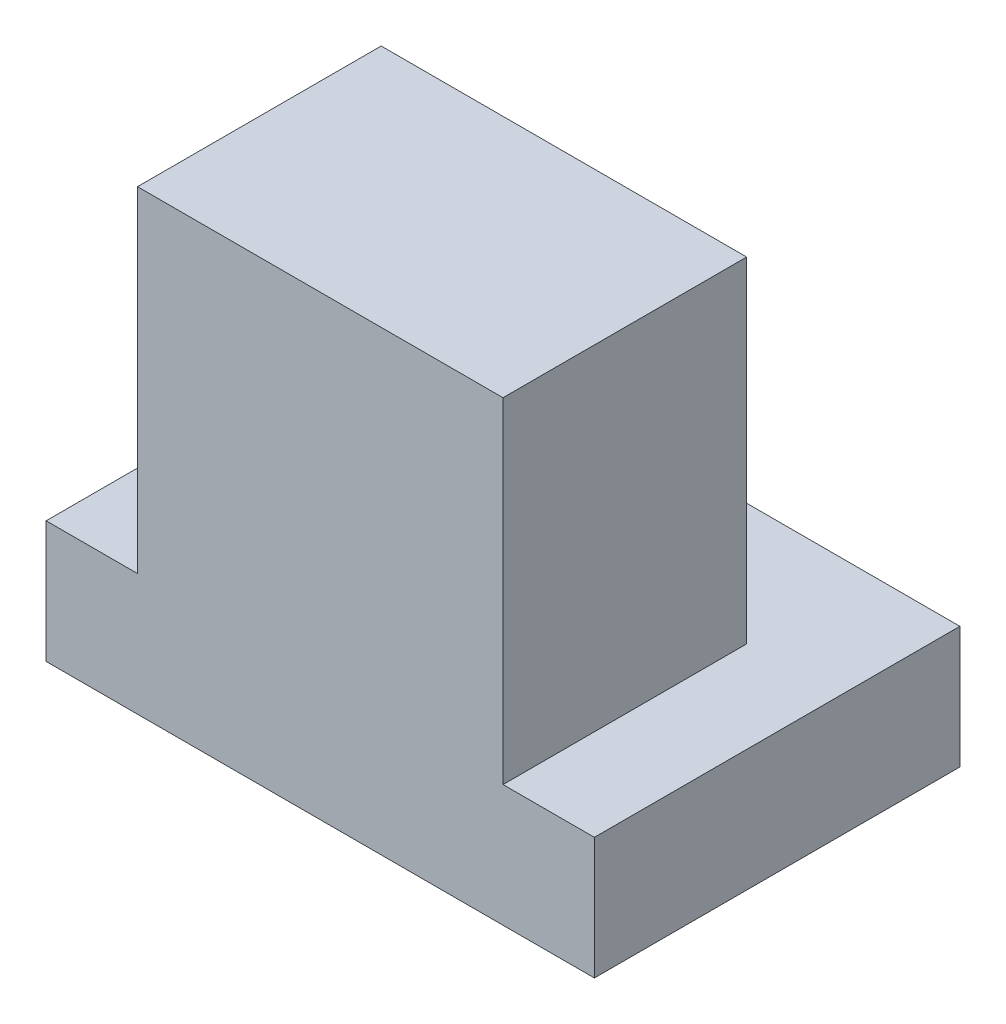
ISO-10303-21;
HEADER;
FILE_DESCRIPTION(('STEP AP214'),'2;1');
FILE_NAME('part.step','',(''),(''),'','','');
FILE_SCHEMA(('AUTOMOTIVE_DESIGN { 1 0 10303 214 1 1 1 1 }'));
ENDSEC;
DATA;
#1=APPLICATION_CONTEXT('core data for automotive mechanical design processes');
#2=APPLICATION_PROTOCOL_DEFINITION('international standard','automotive_design',2000,#1);
#3=PRODUCT_CONTEXT('',#1,'mechanical');
#4=PRODUCT('Part','Part','',(#3));
#5=PRODUCT_RELATED_PRODUCT_CATEGORY('part','',(#4));
#6=PRODUCT_DEFINITION_FORMATION('','',#4);
#7=PRODUCT_DEFINITION_CONTEXT('part definition',#1,'design');
#8=PRODUCT_DEFINITION('design','',#6,#7);
#9=PRODUCT_DEFINITION_SHAPE('','',#8);
#10=(LENGTH_UNIT() NAMED_UNIT(*) SI_UNIT(.MILLI.,.METRE.));
#11=(NAMED_UNIT(*) PLANE_ANGLE_UNIT() SI_UNIT($,.RADIAN.));
#12=(NAMED_UNIT(*) SI_UNIT($,.STERADIAN.) SOLID_ANGLE_UNIT());
#13=UNCERTAINTY_MEASURE_WITH_UNIT(LENGTH_MEASURE(1.E-05),#10,'distance_accuracy_value','');
#14=(GEOMETRIC_REPRESENTATION_CONTEXT(3) GLOBAL_UNCERTAINTY_ASSIGNED_CONTEXT((#13)) GLOBAL_UNIT_ASSIGNED_CONTEXT((#10,
#11,#12)) REPRESENTATION_CONTEXT('',''));
#15=CARTESIAN_POINT('',(0.,0.,0.));
#16=DIRECTION('',(0.,0.,1.));
#17=DIRECTION('',(1.,0.,0.));
#18=AXIS2_PLACEMENT_3D('',#15,#16,#17);
#19=CARTESIAN_POINT('',(7.5,7.5,-4.));
#20=DIRECTION('',(-1.,0.,0.));
#21=DIRECTION('',(0.,0.,1.));
#22=AXIS2_PLACEMENT_3D('',#19,#20,#21);
#23=PLANE('',#22);
#24=DIRECTION('',(0.,-1.,0.));
#25=VECTOR('',#24,1.);
#26=CARTESIAN_POINT('',(7.5,7.5,0.));
#27=LINE('',#26,#25);
#28=CARTESIAN_POINT('',(7.5,7.5,0.));
#29=VERTEX_POINT('',#28);
#30=CARTESIAN_POINT('',(7.5,2.,0.));
#31=VERTEX_POINT('',#30);
#32=EDGE_CURVE('E210',#29,#31,#27,.T.);
#33=ORIENTED_EDGE('',*,*,#32,.T.);
#34=DIRECTION('',(0.,0.,-1.));
#35=VECTOR('',#34,1.);
#36=CARTESIAN_POINT('',(7.5,2.,-4.));
#37=LINE('',#36,#35);
#38=CARTESIAN_POINT('',(7.5,2.,-4.));
#39=VERTEX_POINT('',#38);
#40=EDGE_CURVE('E61',#31,#39,#37,.T.);
#41=ORIENTED_EDGE('',*,*,#40,.T.);
#42=DIRECTION('',(0.,-1.,0.));
#43=VECTOR('',#42,1.);
#44=CARTESIAN_POINT('',(7.5,7.5,-4.));
#45=LINE('',#44,#43);
#46=CARTESIAN_POINT('',(7.5,7.5,-4.));
#47=VERTEX_POINT('',#46);
#48=EDGE_CURVE('E11',#47,#39,#45,.T.);
#49=ORIENTED_EDGE('',*,*,#48,.F.);
#50=DIRECTION('',(0.,0.,-1.));
#51=VECTOR('',#50,1.);
#52=CARTESIAN_POINT('',(7.5,7.5,-4.));
#53=LINE('',#52,#51);
#54=EDGE_CURVE('E201',#29,#47,#53,.T.);
#55=ORIENTED_EDGE('',*,*,#54,.F.);
#56=EDGE_LOOP('',(#33,#41,#49,#55));
#57=FACE_BOUND('',#56,.T.);
#58=ADVANCED_FACE('F47',(#57),#23,.F.);
#59=CARTESIAN_POINT('',(1.5,7.5,-4.));
#60=DIRECTION('',(0.,0.,1.));
#61=DIRECTION('',(1.,0.,0.));
#62=AXIS2_PLACEMENT_3D('',#59,#60,#61);
#63=PLANE('',#62);
#64=ORIENTED_EDGE('',*,*,#48,.T.);
#65=DIRECTION('',(-1.,0.,0.));
#66=VECTOR('',#65,1.);
#67=CARTESIAN_POINT('',(1.5,2.,-4.));
#68=LINE('',#67,#66);
#69=CARTESIAN_POINT('',(1.5,2.,-4.));
#70=VERTEX_POINT('',#69);
#71=EDGE_CURVE('E67',#39,#70,#68,.T.);
#72=ORIENTED_EDGE('',*,*,#71,.T.);
#73=DIRECTION('',(0.,-1.,0.));
#74=VECTOR('',#73,1.);
#75=CARTESIAN_POINT('',(1.5,7.5,-4.));
#76=LINE('',#75,#74);
#77=CARTESIAN_POINT('',(1.5,7.5,-4.));
#78=VERTEX_POINT('',#77);
#79=EDGE_CURVE('E54',#78,#70,#76,.T.);
#80=ORIENTED_EDGE('',*,*,#79,.F.);
#81=DIRECTION('',(-1.,0.,0.));
#82=VECTOR('',#81,1.);
#83=CARTESIAN_POINT('',(1.5,7.5,-4.));
#84=LINE('',#83,#82);
#85=EDGE_CURVE('E204',#47,#78,#84,.T.);
#86=ORIENTED_EDGE('',*,*,#85,.F.);
#87=EDGE_LOOP('',(#64,#72,#80,#86));
#88=FACE_BOUND('',#87,.T.);
#89=ADVANCED_FACE('F253',(#88),#63,.F.);
#90=CARTESIAN_POINT('',(1.5,7.5,-4.));
#91=DIRECTION('',(1.,0.,0.));
#92=DIRECTION('',(0.,0.,-1.));
#93=AXIS2_PLACEMENT_3D('',#90,#91,#92);
#94=PLANE('',#93);
#95=DIRECTION('',(0.,0.,-1.));
#96=VECTOR('',#95,1.);
#97=CARTESIAN_POINT('',(1.5,6.55,-2.775));
#98=LINE('',#97,#96);
#99=CARTESIAN_POINT('',(1.5,6.55,-1.225));
#100=VERTEX_POINT('',#99);
#101=CARTESIAN_POINT('',(1.5,6.55,-2.775));
#102=VERTEX_POINT('',#101);
#103=EDGE_CURVE('E185',#100,#102,#98,.T.);
#104=ORIENTED_EDGE('',*,*,#103,.F.);
#105=DIRECTION('',(0.,1.,0.));
#106=VECTOR('',#105,1.);
#107=CARTESIAN_POINT('',(1.5,6.55,-1.225));
#108=LINE('',#107,#106);
#109=CARTESIAN_POINT('',(1.5,2.45,-1.225));
#110=VERTEX_POINT('',#109);
#111=EDGE_CURVE('E169',#110,#100,#108,.T.);
#112=ORIENTED_EDGE('',*,*,#111,.F.);
#113=DIRECTION('',(0.,0.,1.));
#114=VECTOR('',#113,1.);
#115=CARTESIAN_POINT('',(1.5,2.45,-2.775));
#116=LINE('',#115,#114);
#117=CARTESIAN_POINT('',(1.5,2.45,-2.775));
#118=VERTEX_POINT('',#117);
#119=EDGE_CURVE('E174',#118,#110,#116,.T.);
#120=ORIENTED_EDGE('',*,*,#119,.F.);
#121=DIRECTION('',(0.,-1.,0.));
#122=VECTOR('',#121,1.);
#123=CARTESIAN_POINT('',(1.5,6.55,-2.775));
#124=LINE('',#123,#122);
#125=EDGE_CURVE('E188',#102,#118,#124,.T.);
#126=ORIENTED_EDGE('',*,*,#125,.F.);
#127=EDGE_LOOP('',(#104,#112,#120,#126));
#128=FACE_BOUND('',#127,.T.);
#129=ORIENTED_EDGE('',*,*,#79,.T.);
#130=DIRECTION('',(0.,0.,1.));
#131=VECTOR('',#130,1.);
#132=CARTESIAN_POINT('',(1.5,2.,-4.));
#133=LINE('',#132,#131);
#134=CARTESIAN_POINT('',(1.5,2.,0.));
#135=VERTEX_POINT('',#134);
#136=EDGE_CURVE('E160',#70,#135,#133,.T.);
#137=ORIENTED_EDGE('',*,*,#136,.T.);
#138=DIRECTION('',(0.,-1.,0.));
#139=VECTOR('',#138,1.);
#140=CARTESIAN_POINT('',(1.5,7.5,0.));
#141=LINE('',#140,#139);
#142=CARTESIAN_POINT('',(1.5,7.5,0.));
#143=VERTEX_POINT('',#142);
#144=EDGE_CURVE('E213',#143,#135,#141,.T.);
#145=ORIENTED_EDGE('',*,*,#144,.F.);
#146=DIRECTION('',(0.,0.,1.));
#147=VECTOR('',#146,1.);
#148=CARTESIAN_POINT('',(1.5,7.5,-4.));
#149=LINE('',#148,#147);
#150=EDGE_CURVE('E206',#78,#143,#149,.T.);
#151=ORIENTED_EDGE('',*,*,#150,.F.);
#152=EDGE_LOOP('',(#129,#137,#145,#151));
#153=FACE_BOUND('',#152,.T.);
#154=ADVANCED_FACE('F217',(#128,#153),#94,.F.);
#155=CARTESIAN_POINT('',(1.5,7.5,0.));
#156=DIRECTION('',(0.,0.,-1.));
#157=DIRECTION('',(-1.,0.,0.));
#158=AXIS2_PLACEMENT_3D('',#155,#156,#157);
#159=PLANE('',#158);
#160=ORIENTED_EDGE('',*,*,#144,.T.);
#161=DIRECTION('',(1.,0.,0.));
#162=VECTOR('',#161,1.);
#163=CARTESIAN_POINT('',(0.,2.,0.));
#164=LINE('',#163,#162);
#165=CARTESIAN_POINT('',(0.,2.,0.));
#166=VERTEX_POINT('',#165);
#167=EDGE_CURVE('E143',#166,#135,#164,.T.);
#168=ORIENTED_EDGE('',*,*,#167,.F.);
#169=DIRECTION('',(0.,-1.,0.));
#170=VECTOR('',#169,1.);
#171=CARTESIAN_POINT('',(0.,2.,0.));
#172=LINE('',#171,#170);
#173=CARTESIAN_POINT('',(0.,0.,0.));
#174=VERTEX_POINT('',#173);
#175=EDGE_CURVE('E227',#166,#174,#172,.T.);
#176=ORIENTED_EDGE('',*,*,#175,.T.);
#177=DIRECTION('',(1.,0.,0.));
#178=VECTOR('',#177,1.);
#179=CARTESIAN_POINT('',(1.5,0.,0.));
#180=LINE('',#179,#178);
#181=CARTESIAN_POINT('',(9.,0.,0.));
#182=VERTEX_POINT('',#181);
#183=EDGE_CURVE('E158',#174,#182,#180,.T.);
#184=ORIENTED_EDGE('',*,*,#183,.T.);
#185=DIRECTION('',(0.,-1.,0.));
#186=VECTOR('',#185,1.);
#187=CARTESIAN_POINT('',(9.,2.,0.));
#188=LINE('',#187,#186);
#189=CARTESIAN_POINT('',(9.,2.,0.));
#190=VERTEX_POINT('',#189);
#191=EDGE_CURVE('E149',#190,#182,#188,.T.);
#192=ORIENTED_EDGE('',*,*,#191,.F.);
#193=EDGE_CURVE('E135',#31,#190,#164,.T.);
#194=ORIENTED_EDGE('',*,*,#193,.F.);
#195=ORIENTED_EDGE('',*,*,#32,.F.);
#196=DIRECTION('',(1.,0.,0.));
#197=VECTOR('',#196,1.);
#198=CARTESIAN_POINT('',(1.5,7.5,0.));
#199=LINE('',#198,#197);
#200=EDGE_CURVE('E208',#143,#29,#199,.T.);
#201=ORIENTED_EDGE('',*,*,#200,.F.);
#202=EDGE_LOOP('',(#160,#168,#176,#184,#192,#194,#195,#201));
#203=FACE_BOUND('',#202,.T.);
#204=ADVANCED_FACE('F156',(#203),#159,.F.);
#205=CARTESIAN_POINT('',(0.,7.5,0.));
#206=DIRECTION('',(0.,1.,0.));
#207=DIRECTION('',(0.,0.,1.));
#208=AXIS2_PLACEMENT_3D('',#205,#206,#207);
#209=PLANE('',#208);
#210=ORIENTED_EDGE('',*,*,#54,.T.);
#211=ORIENTED_EDGE('',*,*,#85,.T.);
#212=ORIENTED_EDGE('',*,*,#150,.T.);
#213=ORIENTED_EDGE('',*,*,#200,.T.);
#214=EDGE_LOOP('',(#210,#211,#212,#213));
#215=FACE_BOUND('',#214,.T.);
#216=ADVANCED_FACE('F261',(#215),#209,.T.);
#217=CARTESIAN_POINT('',(0.,0.,0.));
#218=DIRECTION('',(0.,1.,0.));
#219=DIRECTION('',(0.,0.,1.));
#220=AXIS2_PLACEMENT_3D('',#217,#218,#219);
#221=PLANE('',#220);
#222=DIRECTION('',(0.,0.,-1.));
#223=VECTOR('',#222,1.);
#224=CARTESIAN_POINT('',(9.,0.,0.));
#225=LINE('',#224,#223);
#226=CARTESIAN_POINT('',(9.,0.,-6.));
#227=VERTEX_POINT('',#226);
#228=EDGE_CURVE('E228',#182,#227,#225,.T.);
#229=ORIENTED_EDGE('',*,*,#228,.F.);
#230=ORIENTED_EDGE('',*,*,#183,.F.);
#231=DIRECTION('',(0.,0.,1.));
#232=VECTOR('',#231,1.);
#233=CARTESIAN_POINT('',(0.,0.,0.));
#234=LINE('',#233,#232);
#235=CARTESIAN_POINT('',(0.,0.,-6.));
#236=VERTEX_POINT('',#235);
#237=EDGE_CURVE('E144',#236,#174,#234,.T.);
#238=ORIENTED_EDGE('',*,*,#237,.F.);
#239=DIRECTION('',(-1.,0.,0.));
#240=VECTOR('',#239,1.);
#241=CARTESIAN_POINT('',(0.,0.,-6.));
#242=LINE('',#241,#240);
#243=EDGE_CURVE('E230',#227,#236,#242,.T.);
#244=ORIENTED_EDGE('',*,*,#243,.F.);
#245=EDGE_LOOP('',(#229,#230,#238,#244));
#246=FACE_BOUND('',#245,.T.);
#247=ADVANCED_FACE('F242',(#246),#221,.F.);
#248=CARTESIAN_POINT('',(5.5,6.55,-1.225));
#249=DIRECTION('',(0.,0.,1.));
#250=DIRECTION('',(0.,-1.,0.));
#251=AXIS2_PLACEMENT_3D('',#248,#249,#250);
#252=PLANE('',#251);
#253=ORIENTED_EDGE('',*,*,#111,.T.);
#254=DIRECTION('',(-1.,0.,0.));
#255=VECTOR('',#254,1.);
#256=CARTESIAN_POINT('',(5.5,6.55,-1.225));
#257=LINE('',#256,#255);
#258=CARTESIAN_POINT('',(5.5,6.55,-1.225));
#259=VERTEX_POINT('',#258);
#260=EDGE_CURVE('E183',#259,#100,#257,.T.);
#261=ORIENTED_EDGE('',*,*,#260,.F.);
#262=DIRECTION('',(0.,1.,0.));
#263=VECTOR('',#262,1.);
#264=CARTESIAN_POINT('',(5.5,6.55,-1.225));
#265=LINE('',#264,#263);
#266=CARTESIAN_POINT('',(5.5,2.45,-1.225));
#267=VERTEX_POINT('',#266);
#268=EDGE_CURVE('E170',#267,#259,#265,.T.);
#269=ORIENTED_EDGE('',*,*,#268,.F.);
#270=DIRECTION('',(-1.,0.,0.));
#271=VECTOR('',#270,1.);
#272=CARTESIAN_POINT('',(5.5,2.45,-1.225));
#273=LINE('',#272,#271);
#274=EDGE_CURVE('E193',#267,#110,#273,.T.);
#275=ORIENTED_EDGE('',*,*,#274,.T.);
#276=EDGE_LOOP('',(#253,#261,#269,#275));
#277=FACE_BOUND('',#276,.T.);
#278=ADVANCED_FACE('F268',(#277),#252,.F.);
#279=CARTESIAN_POINT('',(5.5,2.45,-2.775));
#280=DIRECTION('',(0.,-1.,0.));
#281=DIRECTION('',(0.,0.,-1.));
#282=AXIS2_PLACEMENT_3D('',#279,#280,#281);
#283=PLANE('',#282);
#284=ORIENTED_EDGE('',*,*,#119,.T.);
#285=ORIENTED_EDGE('',*,*,#274,.F.);
#286=DIRECTION('',(0.,0.,1.));
#287=VECTOR('',#286,1.);
#288=CARTESIAN_POINT('',(5.5,2.45,-2.775));
#289=LINE('',#288,#287);
#290=CARTESIAN_POINT('',(5.5,2.45,-2.775));
#291=VERTEX_POINT('',#290);
#292=EDGE_CURVE('E180',#291,#267,#289,.T.);
#293=ORIENTED_EDGE('',*,*,#292,.F.);
#294=DIRECTION('',(-1.,0.,0.));
#295=VECTOR('',#294,1.);
#296=CARTESIAN_POINT('',(5.5,2.45,-2.775));
#297=LINE('',#296,#295);
#298=EDGE_CURVE('E195',#291,#118,#297,.T.);
#299=ORIENTED_EDGE('',*,*,#298,.T.);
#300=EDGE_LOOP('',(#284,#285,#293,#299));
#301=FACE_BOUND('',#300,.T.);
#302=ADVANCED_FACE('F291',(#301),#283,.F.);
#303=CARTESIAN_POINT('',(5.5,6.55,-2.775));
#304=DIRECTION('',(0.,0.,-1.));
#305=DIRECTION('',(0.,1.,0.));
#306=AXIS2_PLACEMENT_3D('',#303,#304,#305);
#307=PLANE('',#306);
#308=ORIENTED_EDGE('',*,*,#125,.T.);
#309=ORIENTED_EDGE('',*,*,#298,.F.);
#310=DIRECTION('',(0.,-1.,0.));
#311=VECTOR('',#310,1.);
#312=CARTESIAN_POINT('',(5.5,6.55,-2.775));
#313=LINE('',#312,#311);
#314=CARTESIAN_POINT('',(5.5,6.55,-2.775));
#315=VERTEX_POINT('',#314);
#316=EDGE_CURVE('E177',#315,#291,#313,.T.);
#317=ORIENTED_EDGE('',*,*,#316,.F.);
#318=DIRECTION('',(-1.,0.,0.));
#319=VECTOR('',#318,1.);
#320=CARTESIAN_POINT('',(5.5,6.55,-2.775));
#321=LINE('',#320,#319);
#322=EDGE_CURVE('E197',#315,#102,#321,.T.);
#323=ORIENTED_EDGE('',*,*,#322,.T.);
#324=EDGE_LOOP('',(#308,#309,#317,#323));
#325=FACE_BOUND('',#324,.T.);
#326=ADVANCED_FACE('F293',(#325),#307,.F.);
#327=CARTESIAN_POINT('',(5.5,6.55,-2.775));
#328=DIRECTION('',(0.,1.,0.));
#329=DIRECTION('',(0.,0.,1.));
#330=AXIS2_PLACEMENT_3D('',#327,#328,#329);
#331=PLANE('',#330);
#332=ORIENTED_EDGE('',*,*,#103,.T.);
#333=ORIENTED_EDGE('',*,*,#322,.F.);
#334=DIRECTION('',(0.,0.,-1.));
#335=VECTOR('',#334,1.);
#336=CARTESIAN_POINT('',(5.5,6.55,-2.775));
#337=LINE('',#336,#335);
#338=EDGE_CURVE('E173',#259,#315,#337,.T.);
#339=ORIENTED_EDGE('',*,*,#338,.F.);
#340=ORIENTED_EDGE('',*,*,#260,.T.);
#341=EDGE_LOOP('',(#332,#333,#339,#340));
#342=FACE_BOUND('',#341,.T.);
#343=ADVANCED_FACE('F284',(#342),#331,.F.);
#344=CARTESIAN_POINT('',(5.5,0.,0.));
#345=DIRECTION('',(-1.,0.,0.));
#346=DIRECTION('',(0.,0.,1.));
#347=AXIS2_PLACEMENT_3D('',#344,#345,#346);
#348=PLANE('',#347);
#349=ORIENTED_EDGE('',*,*,#268,.T.);
#350=ORIENTED_EDGE('',*,*,#338,.T.);
#351=ORIENTED_EDGE('',*,*,#316,.T.);
#352=ORIENTED_EDGE('',*,*,#292,.T.);
#353=EDGE_LOOP('',(#349,#350,#351,#352));
#354=FACE_BOUND('',#353,.T.);
#355=ADVANCED_FACE('F295',(#354),#348,.T.);
#356=CARTESIAN_POINT('',(0.,2.,0.));
#357=DIRECTION('',(0.,1.,0.));
#358=DIRECTION('',(0.,0.,1.));
#359=AXIS2_PLACEMENT_3D('',#356,#357,#358);
#360=PLANE('',#359);
#361=ORIENTED_EDGE('',*,*,#40,.F.);
#362=ORIENTED_EDGE('',*,*,#193,.T.);
#363=DIRECTION('',(0.,0.,-1.));
#364=VECTOR('',#363,1.);
#365=CARTESIAN_POINT('',(9.,2.,0.));
#366=LINE('',#365,#364);
#367=CARTESIAN_POINT('',(9.,2.,-6.));
#368=VERTEX_POINT('',#367);
#369=EDGE_CURVE('E138',#190,#368,#366,.T.);
#370=ORIENTED_EDGE('',*,*,#369,.T.);
#371=DIRECTION('',(-1.,0.,0.));
#372=VECTOR('',#371,1.);
#373=CARTESIAN_POINT('',(0.,2.,-6.));
#374=LINE('',#373,#372);
#375=CARTESIAN_POINT('',(0.,2.,-6.));
#376=VERTEX_POINT('',#375);
#377=EDGE_CURVE('E153',#368,#376,#374,.T.);
#378=ORIENTED_EDGE('',*,*,#377,.T.);
#379=DIRECTION('',(0.,0.,1.));
#380=VECTOR('',#379,1.);
#381=CARTESIAN_POINT('',(0.,2.,0.));
#382=LINE('',#381,#380);
#383=EDGE_CURVE('E222',#376,#166,#382,.T.);
#384=ORIENTED_EDGE('',*,*,#383,.T.);
#385=ORIENTED_EDGE('',*,*,#167,.T.);
#386=ORIENTED_EDGE('',*,*,#136,.F.);
#387=ORIENTED_EDGE('',*,*,#71,.F.);
#388=EDGE_LOOP('',(#361,#362,#370,#378,#384,#385,#386,#387));
#389=FACE_BOUND('',#388,.T.);
#390=ADVANCED_FACE('F137',(#389),#360,.T.);
#391=CARTESIAN_POINT('',(9.,2.,0.));
#392=DIRECTION('',(-1.,0.,0.));
#393=DIRECTION('',(0.,0.,1.));
#394=AXIS2_PLACEMENT_3D('',#391,#392,#393);
#395=PLANE('',#394);
#396=ORIENTED_EDGE('',*,*,#228,.T.);
#397=DIRECTION('',(0.,-1.,0.));
#398=VECTOR('',#397,1.);
#399=CARTESIAN_POINT('',(9.,2.,-6.));
#400=LINE('',#399,#398);
#401=EDGE_CURVE('E151',#368,#227,#400,.T.);
#402=ORIENTED_EDGE('',*,*,#401,.F.);
#403=ORIENTED_EDGE('',*,*,#369,.F.);
#404=ORIENTED_EDGE('',*,*,#191,.T.);
#405=EDGE_LOOP('',(#396,#402,#403,#404));
#406=FACE_BOUND('',#405,.T.);
#407=ADVANCED_FACE('F148',(#406),#395,.F.);
#408=CARTESIAN_POINT('',(0.,2.,-6.));
#409=DIRECTION('',(0.,0.,1.));
#410=DIRECTION('',(1.,0.,0.));
#411=AXIS2_PLACEMENT_3D('',#408,#409,#410);
#412=PLANE('',#411);
#413=ORIENTED_EDGE('',*,*,#243,.T.);
#414=DIRECTION('',(0.,-1.,0.));
#415=VECTOR('',#414,1.);
#416=CARTESIAN_POINT('',(0.,2.,-6.));
#417=LINE('',#416,#415);
#418=EDGE_CURVE('E163',#376,#236,#417,.T.);
#419=ORIENTED_EDGE('',*,*,#418,.F.);
#420=ORIENTED_EDGE('',*,*,#377,.F.);
#421=ORIENTED_EDGE('',*,*,#401,.T.);
#422=EDGE_LOOP('',(#413,#419,#420,#421));
#423=FACE_BOUND('',#422,.T.);
#424=ADVANCED_FACE('F243',(#423),#412,.F.);
#425=CARTESIAN_POINT('',(0.,2.,0.));
#426=DIRECTION('',(1.,0.,0.));
#427=DIRECTION('',(0.,0.,-1.));
#428=AXIS2_PLACEMENT_3D('',#425,#426,#427);
#429=PLANE('',#428);
#430=ORIENTED_EDGE('',*,*,#237,.T.);
#431=ORIENTED_EDGE('',*,*,#175,.F.);
#432=ORIENTED_EDGE('',*,*,#383,.F.);
#433=ORIENTED_EDGE('',*,*,#418,.T.);
#434=EDGE_LOOP('',(#430,#431,#432,#433));
#435=FACE_BOUND('',#434,.T.);
#436=ADVANCED_FACE('F238',(#435),#429,.F.);
#437=CLOSED_SHELL('',(#58,#89,#154,#204,#216,#247,#278,#302,#326,#343,#355,#390,#407,#424,#436));
#438=MANIFOLD_SOLID_BREP('B2',#437);
#439=ADVANCED_BREP_SHAPE_REPRESENTATION('',(#18,#438),#14);
#440=SHAPE_DEFINITION_REPRESENTATION(#9,#439);
ENDSEC;
END-ISO-10303-21;
